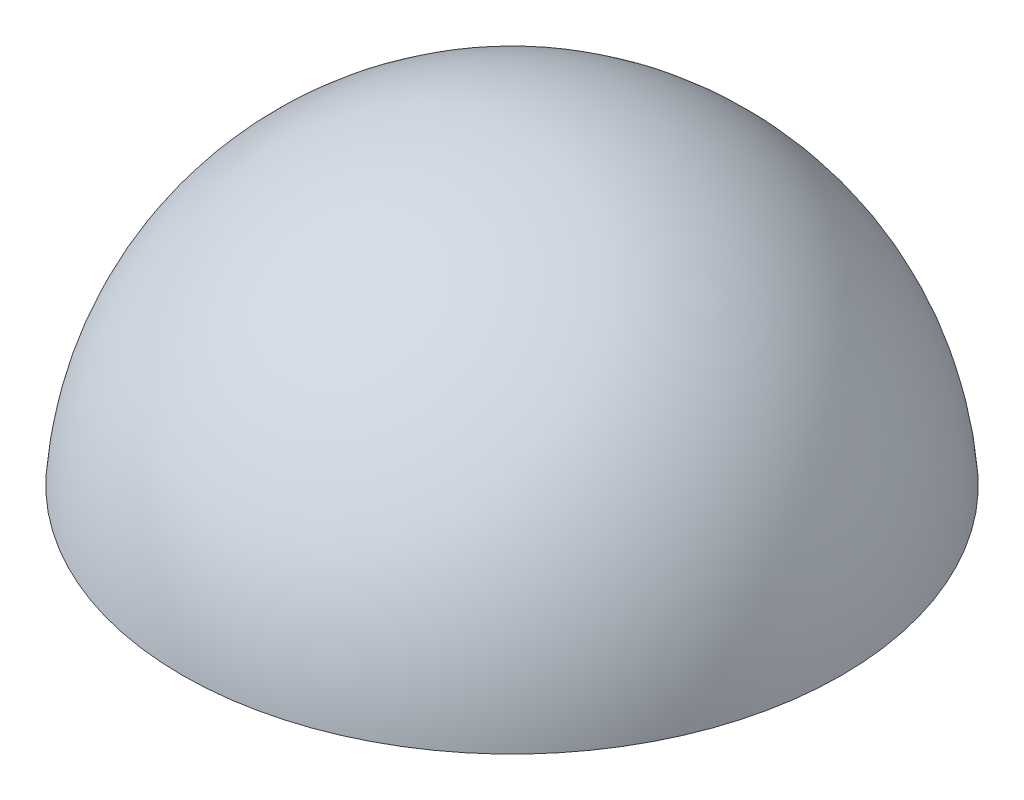
ISO-10303-21;
HEADER;
FILE_DESCRIPTION(('STEP AP214'),'2;1');
FILE_NAME('part.step','',(''),(''),'','','');
FILE_SCHEMA(('AUTOMOTIVE_DESIGN { 1 0 10303 214 1 1 1 1 }'));
ENDSEC;
DATA;
#1=APPLICATION_CONTEXT('core data for automotive mechanical design processes');
#2=APPLICATION_PROTOCOL_DEFINITION('international standard','automotive_design',2000,#1);
#3=PRODUCT_CONTEXT('',#1,'mechanical');
#4=PRODUCT('Part','Part','',(#3));
#5=PRODUCT_RELATED_PRODUCT_CATEGORY('part','',(#4));
#6=PRODUCT_DEFINITION_FORMATION('','',#4);
#7=PRODUCT_DEFINITION_CONTEXT('part definition',#1,'design');
#8=PRODUCT_DEFINITION('design','',#6,#7);
#9=PRODUCT_DEFINITION_SHAPE('','',#8);
#10=(LENGTH_UNIT() NAMED_UNIT(*) SI_UNIT(.MILLI.,.METRE.));
#11=(NAMED_UNIT(*) PLANE_ANGLE_UNIT() SI_UNIT($,.RADIAN.));
#12=(NAMED_UNIT(*) SI_UNIT($,.STERADIAN.) SOLID_ANGLE_UNIT());
#13=UNCERTAINTY_MEASURE_WITH_UNIT(LENGTH_MEASURE(1.E-05),#10,'distance_accuracy_value','');
#14=(GEOMETRIC_REPRESENTATION_CONTEXT(3) GLOBAL_UNCERTAINTY_ASSIGNED_CONTEXT((#13)) GLOBAL_UNIT_ASSIGNED_CONTEXT((#10,
#11,#12)) REPRESENTATION_CONTEXT('',''));
#15=CARTESIAN_POINT('',(0.,0.,0.));
#16=DIRECTION('',(0.,0.,1.));
#17=DIRECTION('',(1.,0.,0.));
#18=AXIS2_PLACEMENT_3D('',#15,#16,#17);
#19=CARTESIAN_POINT('',(0.,0.,0.));
#20=DIRECTION('',(0.,1.,0.));
#21=DIRECTION('',(-1.,0.,0.));
#22=AXIS2_PLACEMENT_3D('',#19,#20,#21);
#23=PLANE('',#22);
#24=CARTESIAN_POINT('',(0.,0.,0.));
#25=DIRECTION('',(0.,-1.,0.));
#26=DIRECTION('',(1.,0.,0.));
#27=AXIS2_PLACEMENT_3D('',#24,#25,#26);
#28=CIRCLE('',#27,16.8354775955927);
#29=CARTESIAN_POINT('',(16.8354775955927,0.,0.));
#30=VERTEX_POINT('',#29);
#31=EDGE_CURVE('E10',#30,#30,#28,.T.);
#32=ORIENTED_EDGE('',*,*,#31,.T.);
#33=EDGE_LOOP('',(#32));
#34=FACE_BOUND('',#33,.T.);
#35=ADVANCED_FACE('F31',(#34),#23,.F.);
#36=CARTESIAN_POINT('',(0.,-1.26728312302641,0.));
#37=DIRECTION('',(0.,-1.,0.));
#38=DIRECTION('',(-1.,0.,0.));
#39=AXIS2_PLACEMENT_3D('',#36,#37,#38);
#40=SPHERICAL_SURFACE('',#39,16.8831073083604);
#41=ORIENTED_EDGE('',*,*,#31,.F.);
#42=EDGE_LOOP('',(#41));
#43=FACE_BOUND('',#42,.T.);
#44=ADVANCED_FACE('F39',(#43),#40,.T.);
#45=CLOSED_SHELL('',(#35,#44));
#46=MANIFOLD_SOLID_BREP('B2',#45);
#47=ADVANCED_BREP_SHAPE_REPRESENTATION('',(#18,#46),#14);
#48=SHAPE_DEFINITION_REPRESENTATION(#9,#47);
ENDSEC;
END-ISO-10303-21;
